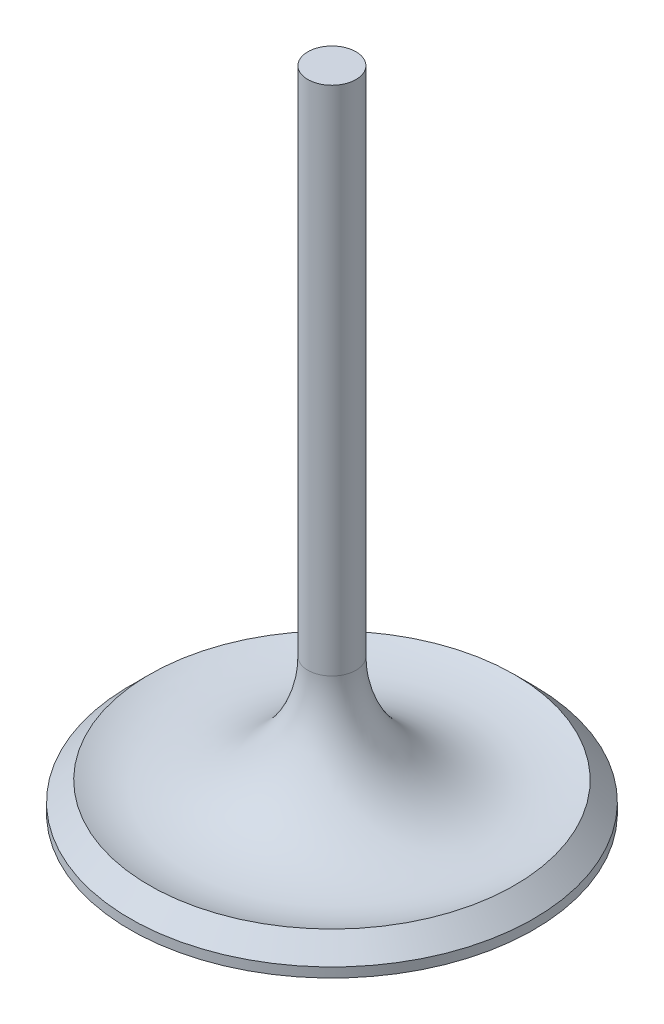
ISO-10303-21;
HEADER;
FILE_DESCRIPTION(('STEP AP214'),'2;1');
FILE_NAME('part.step','',(''),(''),'','','');
FILE_SCHEMA(('AUTOMOTIVE_DESIGN { 1 0 10303 214 1 1 1 1 }'));
ENDSEC;
DATA;
#1=APPLICATION_CONTEXT('core data for automotive mechanical design processes');
#2=APPLICATION_PROTOCOL_DEFINITION('international standard','automotive_design',2000,#1);
#3=PRODUCT_CONTEXT('',#1,'mechanical');
#4=PRODUCT('Part','Part','',(#3));
#5=PRODUCT_RELATED_PRODUCT_CATEGORY('part','',(#4));
#6=PRODUCT_DEFINITION_FORMATION('','',#4);
#7=PRODUCT_DEFINITION_CONTEXT('part definition',#1,'design');
#8=PRODUCT_DEFINITION('design','',#6,#7);
#9=PRODUCT_DEFINITION_SHAPE('','',#8);
#10=(LENGTH_UNIT() NAMED_UNIT(*) SI_UNIT(.MILLI.,.METRE.));
#11=(NAMED_UNIT(*) PLANE_ANGLE_UNIT() SI_UNIT($,.RADIAN.));
#12=(NAMED_UNIT(*) SI_UNIT($,.STERADIAN.) SOLID_ANGLE_UNIT());
#13=UNCERTAINTY_MEASURE_WITH_UNIT(LENGTH_MEASURE(1.E-05),#10,'distance_accuracy_value','');
#14=(GEOMETRIC_REPRESENTATION_CONTEXT(3) GLOBAL_UNCERTAINTY_ASSIGNED_CONTEXT((#13)) GLOBAL_UNIT_ASSIGNED_CONTEXT((#10,
#11,#12)) REPRESENTATION_CONTEXT('',''));
#15=CARTESIAN_POINT('',(0.,0.,0.));
#16=DIRECTION('',(0.,0.,1.));
#17=DIRECTION('',(1.,0.,0.));
#18=AXIS2_PLACEMENT_3D('',#15,#16,#17);
#19=CARTESIAN_POINT('',(26.67,0.,0.));
#20=DIRECTION('',(0.,-1.,0.));
#21=DIRECTION('',(0.,0.,-1.));
#22=AXIS2_PLACEMENT_3D('',#19,#20,#21);
#23=PLANE('',#22);
#24=CARTESIAN_POINT('',(0.,0.,0.));
#25=DIRECTION('',(0.,-1.,0.));
#26=DIRECTION('',(0.,0.,-1.));
#27=AXIS2_PLACEMENT_3D('',#24,#25,#26);
#28=CIRCLE('',#27,26.67);
#29=CARTESIAN_POINT('',(0.,0.,-26.67));
#30=VERTEX_POINT('',#29);
#31=EDGE_CURVE('E10',#30,#30,#28,.T.);
#32=ORIENTED_EDGE('',*,*,#31,.T.);
#33=EDGE_LOOP('',(#32));
#34=FACE_BOUND('',#33,.T.);
#35=ADVANCED_FACE('F35',(#34),#23,.T.);
#36=CARTESIAN_POINT('',(0.,0.,0.));
#37=DIRECTION('',(0.,-1.,0.));
#38=DIRECTION('',(0.,0.,-1.));
#39=AXIS2_PLACEMENT_3D('',#36,#37,#38);
#40=CYLINDRICAL_SURFACE('',#39,26.67);
#41=CARTESIAN_POINT('',(0.,1.27,0.));
#42=DIRECTION('',(0.,-1.,0.));
#43=DIRECTION('',(0.,0.,-1.));
#44=AXIS2_PLACEMENT_3D('',#41,#42,#43);
#45=CIRCLE('',#44,26.67);
#46=CARTESIAN_POINT('',(0.,1.27,-26.67));
#47=VERTEX_POINT('',#46);
#48=EDGE_CURVE('E41',#47,#47,#45,.T.);
#49=ORIENTED_EDGE('',*,*,#48,.T.);
#50=EDGE_LOOP('',(#49));
#51=FACE_BOUND('',#50,.T.);
#52=ORIENTED_EDGE('',*,*,#31,.F.);
#53=EDGE_LOOP('',(#52));
#54=FACE_BOUND('',#53,.T.);
#55=ADVANCED_FACE('F70',(#51,#54),#40,.T.);
#56=CARTESIAN_POINT('',(0.,1.27,0.));
#57=DIRECTION('',(0.,-1.,0.));
#58=DIRECTION('',(0.,0.,-1.));
#59=AXIS2_PLACEMENT_3D('',#56,#57,#58);
#60=CONICAL_SURFACE('',#59,26.67,0.785398163397454);
#61=CARTESIAN_POINT('',(0.,3.81,0.));
#62=DIRECTION('',(0.,-1.,0.));
#63=DIRECTION('',(0.,0.,-1.));
#64=AXIS2_PLACEMENT_3D('',#61,#62,#63);
#65=CIRCLE('',#64,24.13);
#66=CARTESIAN_POINT('',(0.,3.81,-24.13));
#67=VERTEX_POINT('',#66);
#68=EDGE_CURVE('E45',#67,#67,#65,.T.);
#69=ORIENTED_EDGE('',*,*,#68,.T.);
#70=EDGE_LOOP('',(#69));
#71=FACE_BOUND('',#70,.T.);
#72=ORIENTED_EDGE('',*,*,#48,.F.);
#73=EDGE_LOOP('',(#72));
#74=FACE_BOUND('',#73,.T.);
#75=ADVANCED_FACE('F74',(#71,#74),#60,.T.);
#76=CARTESIAN_POINT('',(0.,17.9546986535592,0.));
#77=DIRECTION('',(0.,-1.,0.));
#78=DIRECTION('',(0.,0.,-1.));
#79=AXIS2_PLACEMENT_3D('',#76,#77,#78);
#80=TOROIDAL_SURFACE('',#79,18.43,15.25);
#81=CARTESIAN_POINT('',(0.,17.9546986535592,0.));
#82=DIRECTION('',(0.,-1.,0.));
#83=DIRECTION('',(0.,0.,-1.));
#84=AXIS2_PLACEMENT_3D('',#81,#82,#83);
#85=CIRCLE('',#84,3.18000000000001);
#86=CARTESIAN_POINT('',(0.,17.9546986535592,-3.18000000000001));
#87=VERTEX_POINT('',#86);
#88=EDGE_CURVE('E49',#87,#87,#85,.T.);
#89=ORIENTED_EDGE('',*,*,#88,.T.);
#90=EDGE_LOOP('',(#89));
#91=FACE_BOUND('',#90,.T.);
#92=ORIENTED_EDGE('',*,*,#68,.F.);
#93=EDGE_LOOP('',(#92));
#94=FACE_BOUND('',#93,.T.);
#95=ADVANCED_FACE('F67',(#91,#94),#80,.F.);
#96=CARTESIAN_POINT('',(0.,0.,0.));
#97=DIRECTION('',(0.,-1.,0.));
#98=DIRECTION('',(0.,0.,-1.));
#99=AXIS2_PLACEMENT_3D('',#96,#97,#98);
#100=CYLINDRICAL_SURFACE('',#99,3.18000000000001);
#101=CARTESIAN_POINT('',(0.,85.55,0.));
#102=DIRECTION('',(0.,-1.,0.));
#103=DIRECTION('',(0.,0.,-1.));
#104=AXIS2_PLACEMENT_3D('',#101,#102,#103);
#105=CIRCLE('',#104,3.18);
#106=CARTESIAN_POINT('',(0.,85.55,-3.18));
#107=VERTEX_POINT('',#106);
#108=EDGE_CURVE('E54',#107,#107,#105,.T.);
#109=ORIENTED_EDGE('',*,*,#108,.T.);
#110=EDGE_LOOP('',(#109));
#111=FACE_BOUND('',#110,.T.);
#112=ORIENTED_EDGE('',*,*,#88,.F.);
#113=EDGE_LOOP('',(#112));
#114=FACE_BOUND('',#113,.T.);
#115=ADVANCED_FACE('F58',(#111,#114),#100,.T.);
#116=CARTESIAN_POINT('',(0.,85.55,0.));
#117=DIRECTION('',(0.,1.,0.));
#118=DIRECTION('',(0.,0.,1.));
#119=AXIS2_PLACEMENT_3D('',#116,#117,#118);
#120=PLANE('',#119);
#121=ORIENTED_EDGE('',*,*,#108,.F.);
#122=EDGE_LOOP('',(#121));
#123=FACE_BOUND('',#122,.T.);
#124=ADVANCED_FACE('F61',(#123),#120,.T.);
#125=CLOSED_SHELL('',(#35,#55,#75,#95,#115,#124));
#126=MANIFOLD_SOLID_BREP('B2',#125);
#127=ADVANCED_BREP_SHAPE_REPRESENTATION('',(#18,#126),#14);
#128=SHAPE_DEFINITION_REPRESENTATION(#9,#127);
ENDSEC;
END-ISO-10303-21;
